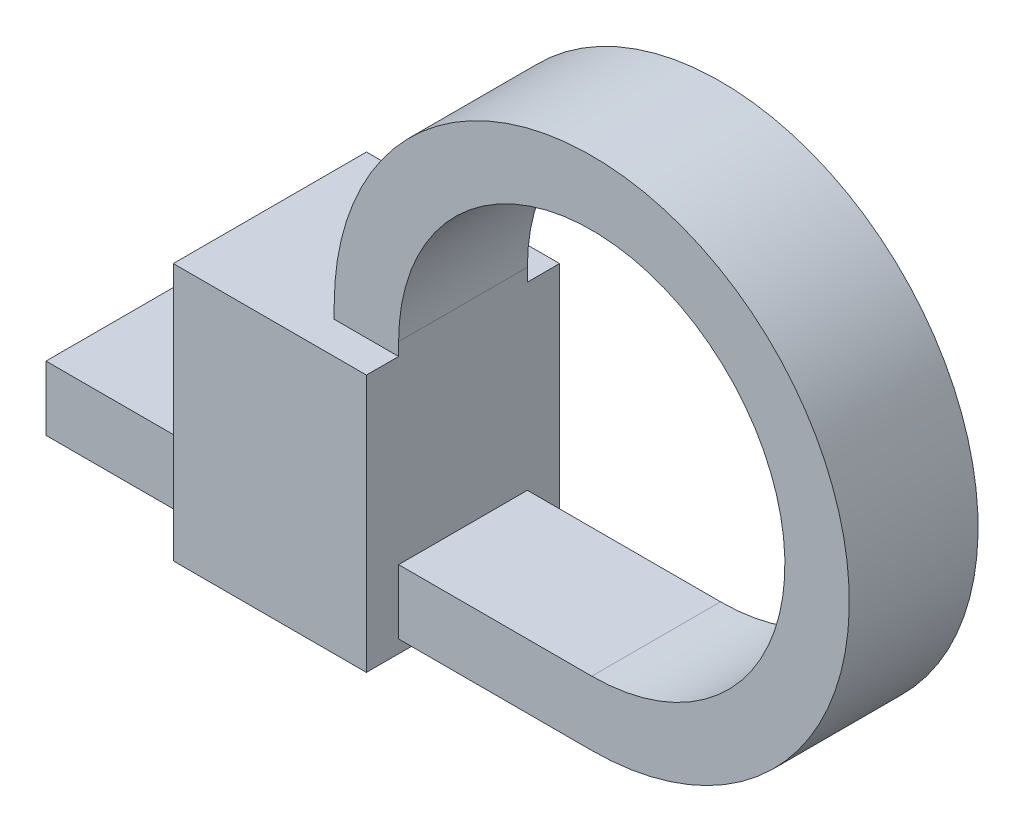
ISO-10303-21;
HEADER;
FILE_DESCRIPTION(('STEP AP214'),'2;1');
FILE_NAME('part.step','',(''),(''),'','','');
FILE_SCHEMA(('AUTOMOTIVE_DESIGN { 1 0 10303 214 1 1 1 1 }'));
ENDSEC;
DATA;
#1=APPLICATION_CONTEXT('core data for automotive mechanical design processes');
#2=APPLICATION_PROTOCOL_DEFINITION('international standard','automotive_design',2000,#1);
#3=PRODUCT_CONTEXT('',#1,'mechanical');
#4=PRODUCT('Part','Part','',(#3));
#5=PRODUCT_RELATED_PRODUCT_CATEGORY('part','',(#4));
#6=PRODUCT_DEFINITION_FORMATION('','',#4);
#7=PRODUCT_DEFINITION_CONTEXT('part definition',#1,'design');
#8=PRODUCT_DEFINITION('design','',#6,#7);
#9=PRODUCT_DEFINITION_SHAPE('','',#8);
#10=(LENGTH_UNIT() NAMED_UNIT(*) SI_UNIT(.MILLI.,.METRE.));
#11=(NAMED_UNIT(*) PLANE_ANGLE_UNIT() SI_UNIT($,.RADIAN.));
#12=(NAMED_UNIT(*) SI_UNIT($,.STERADIAN.) SOLID_ANGLE_UNIT());
#13=UNCERTAINTY_MEASURE_WITH_UNIT(LENGTH_MEASURE(1.E-05),#10,'distance_accuracy_value','');
#14=(GEOMETRIC_REPRESENTATION_CONTEXT(3) GLOBAL_UNCERTAINTY_ASSIGNED_CONTEXT((#13)) GLOBAL_UNIT_ASSIGNED_CONTEXT((#10,
#11,#12)) REPRESENTATION_CONTEXT('',''));
#15=CARTESIAN_POINT('',(0.,0.,0.));
#16=DIRECTION('',(0.,0.,1.));
#17=DIRECTION('',(1.,0.,0.));
#18=AXIS2_PLACEMENT_3D('',#15,#16,#17);
#19=CARTESIAN_POINT('',(-4.40192378864662,2.5,2.));
#20=DIRECTION('',(1.,0.,0.));
#21=DIRECTION('',(0.,1.,0.));
#22=AXIS2_PLACEMENT_3D('',#19,#20,#21);
#23=PLANE('',#22);
#24=DIRECTION('',(0.,0.,-1.));
#25=VECTOR('',#24,1.);
#26=CARTESIAN_POINT('',(-4.40192378864662,3.7,2.));
#27=LINE('',#26,#25);
#28=CARTESIAN_POINT('',(-4.40192378864662,3.7,0.5));
#29=VERTEX_POINT('',#28);
#30=CARTESIAN_POINT('',(-4.40192378864662,3.7,-1.5));
#31=VERTEX_POINT('',#30);
#32=EDGE_CURVE('E54',#29,#31,#27,.T.);
#33=ORIENTED_EDGE('',*,*,#32,.F.);
#34=DIRECTION('',(0.,-1.,0.));
#35=VECTOR('',#34,1.);
#36=CARTESIAN_POINT('',(-4.40192378864662,2.5,0.5));
#37=LINE('',#36,#35);
#38=CARTESIAN_POINT('',(-4.40192378864662,2.7,0.5));
#39=VERTEX_POINT('',#38);
#40=EDGE_CURVE('E208',#29,#39,#37,.T.);
#41=ORIENTED_EDGE('',*,*,#40,.T.);
#42=DIRECTION('',(0.,0.,-1.));
#43=VECTOR('',#42,1.);
#44=CARTESIAN_POINT('',(-4.40192378864662,2.7,2.));
#45=LINE('',#44,#43);
#46=CARTESIAN_POINT('',(-4.40192378864662,2.7,-1.5));
#47=VERTEX_POINT('',#46);
#48=EDGE_CURVE('E210',#39,#47,#45,.T.);
#49=ORIENTED_EDGE('',*,*,#48,.T.);
#50=DIRECTION('',(0.,-1.,0.));
#51=VECTOR('',#50,1.);
#52=CARTESIAN_POINT('',(-4.40192378864662,2.5,-1.5));
#53=LINE('',#52,#51);
#54=EDGE_CURVE('E221',#31,#47,#53,.T.);
#55=ORIENTED_EDGE('',*,*,#54,.F.);
#56=EDGE_LOOP('',(#33,#41,#49,#55));
#57=FACE_BOUND('',#56,.T.);
#58=DIRECTION('',(0.,-1.,0.));
#59=VECTOR('',#58,1.);
#60=CARTESIAN_POINT('',(-4.40192378864662,2.5,-2.));
#61=LINE('',#60,#59);
#62=CARTESIAN_POINT('',(-4.40192378864662,6.5,-2.));
#63=VERTEX_POINT('',#62);
#64=CARTESIAN_POINT('',(-4.40192378864662,2.5,-2.));
#65=VERTEX_POINT('',#64);
#66=EDGE_CURVE('E167',#63,#65,#61,.T.);
#67=ORIENTED_EDGE('',*,*,#66,.T.);
#68=DIRECTION('',(0.,0.,-1.));
#69=VECTOR('',#68,1.);
#70=CARTESIAN_POINT('',(-4.40192378864662,2.5,2.));
#71=LINE('',#70,#69);
#72=CARTESIAN_POINT('',(-4.40192378864662,2.5,1.));
#73=VERTEX_POINT('',#72);
#74=EDGE_CURVE('E161',#73,#65,#71,.T.);
#75=ORIENTED_EDGE('',*,*,#74,.F.);
#76=DIRECTION('',(0.,-1.,0.));
#77=VECTOR('',#76,1.);
#78=CARTESIAN_POINT('',(-4.40192378864662,2.5,1.));
#79=LINE('',#78,#77);
#80=CARTESIAN_POINT('',(-4.40192378864662,6.5,1.));
#81=VERTEX_POINT('',#80);
#82=EDGE_CURVE('E182',#81,#73,#79,.T.);
#83=ORIENTED_EDGE('',*,*,#82,.F.);
#84=DIRECTION('',(0.,0.,-1.));
#85=VECTOR('',#84,1.);
#86=CARTESIAN_POINT('',(-4.40192378864662,6.5,2.));
#87=LINE('',#86,#85);
#88=EDGE_CURVE('E188',#81,#63,#87,.T.);
#89=ORIENTED_EDGE('',*,*,#88,.T.);
#90=EDGE_LOOP('',(#67,#75,#83,#89));
#91=FACE_BOUND('',#90,.T.);
#92=ADVANCED_FACE('F35',(#57,#91),#23,.F.);
#93=CARTESIAN_POINT('',(-1.40192378864662,2.5,2.));
#94=DIRECTION('',(-1.,0.,0.));
#95=DIRECTION('',(0.,0.,1.));
#96=AXIS2_PLACEMENT_3D('',#93,#94,#95);
#97=PLANE('',#96);
#98=DIRECTION('',(0.,0.,1.));
#99=VECTOR('',#98,1.);
#100=CARTESIAN_POINT('',(-1.40192378864662,2.7,2.));
#101=LINE('',#100,#99);
#102=CARTESIAN_POINT('',(-1.40192378864662,2.7,-1.5));
#103=VERTEX_POINT('',#102);
#104=CARTESIAN_POINT('',(-1.40192378864662,2.7,0.5));
#105=VERTEX_POINT('',#104);
#106=EDGE_CURVE('E45',#103,#105,#101,.T.);
#107=ORIENTED_EDGE('',*,*,#106,.T.);
#108=DIRECTION('',(0.,1.,0.));
#109=VECTOR('',#108,1.);
#110=CARTESIAN_POINT('',(-1.40192378864662,2.5,0.5));
#111=LINE('',#110,#109);
#112=CARTESIAN_POINT('',(-1.40192378864662,3.7,0.5));
#113=VERTEX_POINT('',#112);
#114=EDGE_CURVE('E211',#105,#113,#111,.T.);
#115=ORIENTED_EDGE('',*,*,#114,.T.);
#116=DIRECTION('',(0.,0.,1.));
#117=VECTOR('',#116,1.);
#118=CARTESIAN_POINT('',(-1.40192378864662,3.7,2.));
#119=LINE('',#118,#117);
#120=CARTESIAN_POINT('',(-1.40192378864662,3.7,-1.5));
#121=VERTEX_POINT('',#120);
#122=EDGE_CURVE('E12',#121,#113,#119,.T.);
#123=ORIENTED_EDGE('',*,*,#122,.F.);
#124=DIRECTION('',(0.,1.,0.));
#125=VECTOR('',#124,1.);
#126=CARTESIAN_POINT('',(-1.40192378864662,2.5,-1.5));
#127=LINE('',#126,#125);
#128=EDGE_CURVE('E290',#103,#121,#127,.T.);
#129=ORIENTED_EDGE('',*,*,#128,.F.);
#130=EDGE_LOOP('',(#107,#115,#123,#129));
#131=FACE_BOUND('',#130,.T.);
#132=DIRECTION('',(0.,1.,0.));
#133=VECTOR('',#132,1.);
#134=CARTESIAN_POINT('',(-1.40192378864662,2.5,-2.));
#135=LINE('',#134,#133);
#136=CARTESIAN_POINT('',(-1.40192378864662,2.5,-2.));
#137=VERTEX_POINT('',#136);
#138=CARTESIAN_POINT('',(-1.40192378864662,6.5,-2.));
#139=VERTEX_POINT('',#138);
#140=EDGE_CURVE('E166',#137,#139,#135,.T.);
#141=ORIENTED_EDGE('',*,*,#140,.T.);
#142=DIRECTION('',(0.,0.,-1.));
#143=VECTOR('',#142,1.);
#144=CARTESIAN_POINT('',(-1.40192378864662,6.5,2.));
#145=LINE('',#144,#143);
#146=CARTESIAN_POINT('',(-1.40192378864662,6.5,-1.5));
#147=VERTEX_POINT('',#146);
#148=EDGE_CURVE('E191',#147,#139,#145,.T.);
#149=ORIENTED_EDGE('',*,*,#148,.F.);
#150=DIRECTION('',(0.,1.,0.));
#151=VECTOR('',#150,1.);
#152=CARTESIAN_POINT('',(-1.40192378864662,6.5,-1.5));
#153=LINE('',#152,#151);
#154=CARTESIAN_POINT('',(-1.40192378864662,6.7,-1.5));
#155=VERTEX_POINT('',#154);
#156=EDGE_CURVE('E273',#147,#155,#153,.T.);
#157=ORIENTED_EDGE('',*,*,#156,.T.);
#158=DIRECTION('',(0.,0.,-1.));
#159=VECTOR('',#158,1.);
#160=CARTESIAN_POINT('',(-1.40192378864662,6.7,1.5));
#161=LINE('',#160,#159);
#162=CARTESIAN_POINT('',(-1.40192378864662,6.7,0.5));
#163=VERTEX_POINT('',#162);
#164=EDGE_CURVE('E277',#163,#155,#161,.T.);
#165=ORIENTED_EDGE('',*,*,#164,.F.);
#166=DIRECTION('',(0.,1.,0.));
#167=VECTOR('',#166,1.);
#168=CARTESIAN_POINT('',(-1.40192378864662,2.5,0.5));
#169=LINE('',#168,#167);
#170=CARTESIAN_POINT('',(-1.40192378864662,6.5,0.5));
#171=VERTEX_POINT('',#170);
#172=EDGE_CURVE('E227',#171,#163,#169,.T.);
#173=ORIENTED_EDGE('',*,*,#172,.F.);
#174=CARTESIAN_POINT('',(-1.40192378864662,6.5,1.));
#175=VERTEX_POINT('',#174);
#176=EDGE_CURVE('E177',#175,#171,#145,.T.);
#177=ORIENTED_EDGE('',*,*,#176,.F.);
#178=DIRECTION('',(0.,1.,0.));
#179=VECTOR('',#178,1.);
#180=CARTESIAN_POINT('',(-1.40192378864662,2.5,1.));
#181=LINE('',#180,#179);
#182=CARTESIAN_POINT('',(-1.40192378864662,2.5,1.));
#183=VERTEX_POINT('',#182);
#184=EDGE_CURVE('E176',#183,#175,#181,.T.);
#185=ORIENTED_EDGE('',*,*,#184,.F.);
#186=DIRECTION('',(0.,0.,-1.));
#187=VECTOR('',#186,1.);
#188=CARTESIAN_POINT('',(-1.40192378864662,2.5,2.));
#189=LINE('',#188,#187);
#190=EDGE_CURVE('E158',#183,#137,#189,.T.);
#191=ORIENTED_EDGE('',*,*,#190,.T.);
#192=EDGE_LOOP('',(#141,#149,#157,#165,#173,#177,#185,#191));
#193=FACE_BOUND('',#192,.T.);
#194=ADVANCED_FACE('F172',(#131,#193),#97,.F.);
#195=CARTESIAN_POINT('',(-4.40192378864662,6.5,2.));
#196=DIRECTION('',(0.,-1.,0.));
#197=DIRECTION('',(1.,0.,0.));
#198=AXIS2_PLACEMENT_3D('',#195,#196,#197);
#199=PLANE('',#198);
#200=ORIENTED_EDGE('',*,*,#176,.T.);
#201=DIRECTION('',(-1.,0.,0.));
#202=VECTOR('',#201,1.);
#203=CARTESIAN_POINT('',(-4.40192378864662,6.5,0.5));
#204=LINE('',#203,#202);
#205=CARTESIAN_POINT('',(-2.40192378864662,6.5,0.5));
#206=VERTEX_POINT('',#205);
#207=EDGE_CURVE('E229',#171,#206,#204,.T.);
#208=ORIENTED_EDGE('',*,*,#207,.T.);
#209=DIRECTION('',(0.,0.,-1.));
#210=VECTOR('',#209,1.);
#211=CARTESIAN_POINT('',(-2.40192378864662,6.5,1.5));
#212=LINE('',#211,#210);
#213=CARTESIAN_POINT('',(-2.40192378864662,6.5,-1.5));
#214=VERTEX_POINT('',#213);
#215=EDGE_CURVE('E280',#206,#214,#212,.T.);
#216=ORIENTED_EDGE('',*,*,#215,.T.);
#217=DIRECTION('',(-1.,0.,0.));
#218=VECTOR('',#217,1.);
#219=CARTESIAN_POINT('',(-1.40192378864662,6.5,-1.5));
#220=LINE('',#219,#218);
#221=EDGE_CURVE('E270',#147,#214,#220,.T.);
#222=ORIENTED_EDGE('',*,*,#221,.F.);
#223=ORIENTED_EDGE('',*,*,#148,.T.);
#224=DIRECTION('',(-1.,0.,0.));
#225=VECTOR('',#224,1.);
#226=CARTESIAN_POINT('',(-4.40192378864662,6.5,-2.));
#227=LINE('',#226,#225);
#228=EDGE_CURVE('E180',#139,#63,#227,.T.);
#229=ORIENTED_EDGE('',*,*,#228,.T.);
#230=ORIENTED_EDGE('',*,*,#88,.F.);
#231=DIRECTION('',(-1.,0.,0.));
#232=VECTOR('',#231,1.);
#233=CARTESIAN_POINT('',(-4.40192378864661,6.5,1.));
#234=LINE('',#233,#232);
#235=EDGE_CURVE('E192',#175,#81,#234,.T.);
#236=ORIENTED_EDGE('',*,*,#235,.F.);
#237=EDGE_LOOP('',(#200,#208,#216,#222,#223,#229,#230,#236));
#238=FACE_BOUND('',#237,.T.);
#239=ADVANCED_FACE('F326',(#238),#199,.F.);
#240=CARTESIAN_POINT('',(-4.40192378864662,2.5,1.));
#241=DIRECTION('',(0.,0.,-1.));
#242=DIRECTION('',(-1.,0.,0.));
#243=AXIS2_PLACEMENT_3D('',#240,#241,#242);
#244=PLANE('',#243);
#245=ORIENTED_EDGE('',*,*,#82,.T.);
#246=DIRECTION('',(1.,0.,0.));
#247=VECTOR('',#246,1.);
#248=CARTESIAN_POINT('',(-4.40192378864662,2.5,1.));
#249=LINE('',#248,#247);
#250=EDGE_CURVE('E204',#73,#183,#249,.T.);
#251=ORIENTED_EDGE('',*,*,#250,.T.);
#252=ORIENTED_EDGE('',*,*,#184,.T.);
#253=ORIENTED_EDGE('',*,*,#235,.T.);
#254=EDGE_LOOP('',(#245,#251,#252,#253));
#255=FACE_BOUND('',#254,.T.);
#256=ADVANCED_FACE('F329',(#255),#244,.F.);
#257=CARTESIAN_POINT('',(-4.40192378864662,2.5,-2.));
#258=DIRECTION('',(0.,0.,-1.));
#259=DIRECTION('',(-1.,0.,0.));
#260=AXIS2_PLACEMENT_3D('',#257,#258,#259);
#261=PLANE('',#260);
#262=ORIENTED_EDGE('',*,*,#66,.F.);
#263=ORIENTED_EDGE('',*,*,#228,.F.);
#264=ORIENTED_EDGE('',*,*,#140,.F.);
#265=DIRECTION('',(1.,0.,0.));
#266=VECTOR('',#265,1.);
#267=CARTESIAN_POINT('',(-4.40192378864662,2.5,-2.));
#268=LINE('',#267,#266);
#269=EDGE_CURVE('E155',#65,#137,#268,.T.);
#270=ORIENTED_EDGE('',*,*,#269,.F.);
#271=EDGE_LOOP('',(#262,#263,#264,#270));
#272=FACE_BOUND('',#271,.T.);
#273=ADVANCED_FACE('F179',(#272),#261,.T.);
#274=CARTESIAN_POINT('',(1.59807621135338,6.7,1.5));
#275=DIRECTION('',(0.,0.,-1.));
#276=DIRECTION('',(-1.,0.,0.));
#277=AXIS2_PLACEMENT_3D('',#274,#275,#276);
#278=CYLINDRICAL_SURFACE('',#277,4.);
#279=CARTESIAN_POINT('',(1.59807621135338,6.7,-1.5));
#280=DIRECTION('',(0.,0.,1.));
#281=DIRECTION('',(1.,0.,0.));
#282=AXIS2_PLACEMENT_3D('',#279,#280,#281);
#283=CIRCLE('',#282,4.);
#284=CARTESIAN_POINT('',(-2.40192378864662,6.7,-1.5));
#285=VERTEX_POINT('',#284);
#286=CARTESIAN_POINT('',(1.59807621135338,2.7,-1.5));
#287=VERTEX_POINT('',#286);
#288=EDGE_CURVE('E264',#285,#287,#283,.F.);
#289=ORIENTED_EDGE('',*,*,#288,.F.);
#290=DIRECTION('',(0.,0.,-1.));
#291=VECTOR('',#290,1.);
#292=CARTESIAN_POINT('',(-2.40192378864662,6.7,1.5));
#293=LINE('',#292,#291);
#294=CARTESIAN_POINT('',(-2.40192378864662,6.7,0.5));
#295=VERTEX_POINT('',#294);
#296=EDGE_CURVE('E282',#295,#285,#293,.T.);
#297=ORIENTED_EDGE('',*,*,#296,.F.);
#298=CARTESIAN_POINT('',(1.59807621135338,6.7,0.5));
#299=DIRECTION('',(0.,0.,1.));
#300=DIRECTION('',(1.,0.,0.));
#301=AXIS2_PLACEMENT_3D('',#298,#299,#300);
#302=CIRCLE('',#301,4.);
#303=CARTESIAN_POINT('',(1.59807621135338,2.7,0.5));
#304=VERTEX_POINT('',#303);
#305=EDGE_CURVE('E233',#295,#304,#302,.F.);
#306=ORIENTED_EDGE('',*,*,#305,.T.);
#307=DIRECTION('',(0.,0.,-1.));
#308=VECTOR('',#307,1.);
#309=CARTESIAN_POINT('',(1.59807621135338,2.7,1.5));
#310=LINE('',#309,#308);
#311=EDGE_CURVE('E90',#304,#287,#310,.T.);
#312=ORIENTED_EDGE('',*,*,#311,.T.);
#313=EDGE_LOOP('',(#289,#297,#306,#312));
#314=FACE_BOUND('',#313,.T.);
#315=ADVANCED_FACE('F336',(#314),#278,.T.);
#316=CARTESIAN_POINT('',(1.59807621135338,6.7,1.5));
#317=DIRECTION('',(0.,0.,-1.));
#318=DIRECTION('',(-1.,0.,0.));
#319=AXIS2_PLACEMENT_3D('',#316,#317,#318);
#320=CYLINDRICAL_SURFACE('',#319,3.);
#321=CARTESIAN_POINT('',(1.59807621135338,6.7,-1.5));
#322=DIRECTION('',(0.,0.,-1.));
#323=DIRECTION('',(-1.,0.,0.));
#324=AXIS2_PLACEMENT_3D('',#321,#322,#323);
#325=CIRCLE('',#324,3.);
#326=CARTESIAN_POINT('',(1.59807621135338,3.7,-1.5));
#327=VERTEX_POINT('',#326);
#328=EDGE_CURVE('E219',#155,#327,#325,.T.);
#329=ORIENTED_EDGE('',*,*,#328,.T.);
#330=DIRECTION('',(0.,0.,-1.));
#331=VECTOR('',#330,1.);
#332=CARTESIAN_POINT('',(1.59807621135338,3.7,1.5));
#333=LINE('',#332,#331);
#334=CARTESIAN_POINT('',(1.59807621135338,3.7,0.5));
#335=VERTEX_POINT('',#334);
#336=EDGE_CURVE('E226',#335,#327,#333,.T.);
#337=ORIENTED_EDGE('',*,*,#336,.F.);
#338=CARTESIAN_POINT('',(1.59807621135338,6.7,0.5));
#339=DIRECTION('',(0.,0.,1.));
#340=DIRECTION('',(1.,0.,0.));
#341=AXIS2_PLACEMENT_3D('',#338,#339,#340);
#342=CIRCLE('',#341,3.);
#343=EDGE_CURVE('E224',#163,#335,#342,.F.);
#344=ORIENTED_EDGE('',*,*,#343,.F.);
#345=ORIENTED_EDGE('',*,*,#164,.T.);
#346=EDGE_LOOP('',(#329,#337,#344,#345));
#347=FACE_BOUND('',#346,.T.);
#348=ADVANCED_FACE('F346',(#347),#320,.F.);
#349=CARTESIAN_POINT('',(1.59807621135338,6.7,0.5));
#350=DIRECTION('',(0.,0.,1.));
#351=DIRECTION('',(1.,0.,0.));
#352=AXIS2_PLACEMENT_3D('',#349,#350,#351);
#353=PLANE('',#352);
#354=ORIENTED_EDGE('',*,*,#114,.F.);
#355=DIRECTION('',(-1.,0.,0.));
#356=VECTOR('',#355,1.);
#357=CARTESIAN_POINT('',(1.59807621135338,2.7,0.5));
#358=LINE('',#357,#356);
#359=EDGE_CURVE('E39',#304,#105,#358,.T.);
#360=ORIENTED_EDGE('',*,*,#359,.F.);
#361=ORIENTED_EDGE('',*,*,#305,.F.);
#362=DIRECTION('',(0.,1.,0.));
#363=VECTOR('',#362,1.);
#364=CARTESIAN_POINT('',(-2.40192378864662,6.5,0.5));
#365=LINE('',#364,#363);
#366=EDGE_CURVE('E231',#206,#295,#365,.T.);
#367=ORIENTED_EDGE('',*,*,#366,.F.);
#368=ORIENTED_EDGE('',*,*,#207,.F.);
#369=ORIENTED_EDGE('',*,*,#172,.T.);
#370=ORIENTED_EDGE('',*,*,#343,.T.);
#371=DIRECTION('',(-1.,0.,0.));
#372=VECTOR('',#371,1.);
#373=CARTESIAN_POINT('',(1.59807621135338,3.7,0.5));
#374=LINE('',#373,#372);
#375=EDGE_CURVE('E216',#335,#113,#374,.T.);
#376=ORIENTED_EDGE('',*,*,#375,.T.);
#377=EDGE_LOOP('',(#354,#360,#361,#367,#368,#369,#370,#376));
#378=FACE_BOUND('',#377,.T.);
#379=ADVANCED_FACE('F37',(#378),#353,.T.);
#380=CARTESIAN_POINT('',(1.59807621135338,6.7,-1.5));
#381=DIRECTION('',(0.,0.,1.));
#382=DIRECTION('',(1.,0.,0.));
#383=AXIS2_PLACEMENT_3D('',#380,#381,#382);
#384=PLANE('',#383);
#385=DIRECTION('',(-1.,0.,0.));
#386=VECTOR('',#385,1.);
#387=CARTESIAN_POINT('',(1.59807621135338,2.7,-1.5));
#388=LINE('',#387,#386);
#389=EDGE_CURVE('E262',#287,#103,#388,.T.);
#390=ORIENTED_EDGE('',*,*,#389,.T.);
#391=ORIENTED_EDGE('',*,*,#128,.T.);
#392=DIRECTION('',(-1.,0.,0.));
#393=VECTOR('',#392,1.);
#394=CARTESIAN_POINT('',(1.59807621135338,3.7,-1.5));
#395=LINE('',#394,#393);
#396=EDGE_CURVE('E251',#327,#121,#395,.T.);
#397=ORIENTED_EDGE('',*,*,#396,.F.);
#398=ORIENTED_EDGE('',*,*,#328,.F.);
#399=ORIENTED_EDGE('',*,*,#156,.F.);
#400=ORIENTED_EDGE('',*,*,#221,.T.);
#401=DIRECTION('',(0.,1.,0.));
#402=VECTOR('',#401,1.);
#403=CARTESIAN_POINT('',(-2.40192378864662,6.5,-1.5));
#404=LINE('',#403,#402);
#405=EDGE_CURVE('E267',#214,#285,#404,.T.);
#406=ORIENTED_EDGE('',*,*,#405,.T.);
#407=ORIENTED_EDGE('',*,*,#288,.T.);
#408=EDGE_LOOP('',(#390,#391,#397,#398,#399,#400,#406,#407));
#409=FACE_BOUND('',#408,.T.);
#410=ADVANCED_FACE('F344',(#409),#384,.F.);
#411=CARTESIAN_POINT('',(-2.40192378864662,6.5,1.5));
#412=DIRECTION('',(-1.,0.,0.));
#413=DIRECTION('',(0.,0.,1.));
#414=AXIS2_PLACEMENT_3D('',#411,#412,#413);
#415=PLANE('',#414);
#416=ORIENTED_EDGE('',*,*,#405,.F.);
#417=ORIENTED_EDGE('',*,*,#215,.F.);
#418=ORIENTED_EDGE('',*,*,#366,.T.);
#419=ORIENTED_EDGE('',*,*,#296,.T.);
#420=EDGE_LOOP('',(#416,#417,#418,#419));
#421=FACE_BOUND('',#420,.T.);
#422=ADVANCED_FACE('F320',(#421),#415,.T.);
#423=CARTESIAN_POINT('',(1.59807621135338,2.7,1.5));
#424=DIRECTION('',(0.,-1.,0.));
#425=DIRECTION('',(1.,0.,0.));
#426=AXIS2_PLACEMENT_3D('',#423,#424,#425);
#427=PLANE('',#426);
#428=ORIENTED_EDGE('',*,*,#106,.F.);
#429=ORIENTED_EDGE('',*,*,#389,.F.);
#430=ORIENTED_EDGE('',*,*,#311,.F.);
#431=ORIENTED_EDGE('',*,*,#359,.T.);
#432=EDGE_LOOP('',(#428,#429,#430,#431));
#433=FACE_BOUND('',#432,.T.);
#434=ADVANCED_FACE('F238',(#433),#427,.T.);
#435=CARTESIAN_POINT('',(1.59807621135338,3.7,1.5));
#436=DIRECTION('',(0.,-1.,0.));
#437=DIRECTION('',(1.,0.,0.));
#438=AXIS2_PLACEMENT_3D('',#435,#436,#437);
#439=PLANE('',#438);
#440=ORIENTED_EDGE('',*,*,#396,.T.);
#441=ORIENTED_EDGE('',*,*,#122,.T.);
#442=ORIENTED_EDGE('',*,*,#375,.F.);
#443=ORIENTED_EDGE('',*,*,#336,.T.);
#444=EDGE_LOOP('',(#440,#441,#442,#443));
#445=FACE_BOUND('',#444,.T.);
#446=ADVANCED_FACE('F248',(#445),#439,.F.);
#447=DIRECTION('',(-1.,0.,0.));
#448=VECTOR('',#447,1.);
#449=CARTESIAN_POINT('',(1.59807621135338,3.7,0.5));
#450=LINE('',#449,#448);
#451=CARTESIAN_POINT('',(-6.87859684007711,3.7,0.5));
#452=VERTEX_POINT('',#451);
#453=EDGE_CURVE('E217',#29,#452,#450,.T.);
#454=ORIENTED_EDGE('',*,*,#453,.F.);
#455=ORIENTED_EDGE('',*,*,#32,.T.);
#456=CARTESIAN_POINT('',(-6.87859684007711,3.7,-1.5));
#457=VERTEX_POINT('',#456);
#458=EDGE_CURVE('E256',#31,#457,#395,.T.);
#459=ORIENTED_EDGE('',*,*,#458,.T.);
#460=DIRECTION('',(0.,0.,-1.));
#461=VECTOR('',#460,1.);
#462=CARTESIAN_POINT('',(-6.87859684007711,3.7,1.5));
#463=LINE('',#462,#461);
#464=EDGE_CURVE('E287',#452,#457,#463,.T.);
#465=ORIENTED_EDGE('',*,*,#464,.F.);
#466=EDGE_LOOP('',(#454,#455,#459,#465));
#467=FACE_BOUND('',#466,.T.);
#468=ADVANCED_FACE('F297',(#467),#439,.F.);
#469=ORIENTED_EDGE('',*,*,#48,.F.);
#470=DIRECTION('',(-1.,0.,0.));
#471=VECTOR('',#470,1.);
#472=CARTESIAN_POINT('',(1.59807621135338,2.7,0.5));
#473=LINE('',#472,#471);
#474=CARTESIAN_POINT('',(-6.87859684007711,2.7,0.5));
#475=VERTEX_POINT('',#474);
#476=EDGE_CURVE('E97',#39,#475,#473,.T.);
#477=ORIENTED_EDGE('',*,*,#476,.T.);
#478=DIRECTION('',(0.,0.,-1.));
#479=VECTOR('',#478,1.);
#480=CARTESIAN_POINT('',(-6.87859684007711,2.7,1.5));
#481=LINE('',#480,#479);
#482=CARTESIAN_POINT('',(-6.87859684007711,2.7,-1.5));
#483=VERTEX_POINT('',#482);
#484=EDGE_CURVE('E285',#475,#483,#481,.T.);
#485=ORIENTED_EDGE('',*,*,#484,.T.);
#486=EDGE_CURVE('E259',#47,#483,#388,.T.);
#487=ORIENTED_EDGE('',*,*,#486,.F.);
#488=EDGE_LOOP('',(#469,#477,#485,#487));
#489=FACE_BOUND('',#488,.T.);
#490=ADVANCED_FACE('F309',(#489),#427,.T.);
#491=ORIENTED_EDGE('',*,*,#40,.F.);
#492=ORIENTED_EDGE('',*,*,#453,.T.);
#493=DIRECTION('',(0.,1.,0.));
#494=VECTOR('',#493,1.);
#495=CARTESIAN_POINT('',(-6.87859684007711,2.7,0.5));
#496=LINE('',#495,#494);
#497=EDGE_CURVE('E213',#475,#452,#496,.T.);
#498=ORIENTED_EDGE('',*,*,#497,.F.);
#499=ORIENTED_EDGE('',*,*,#476,.F.);
#500=EDGE_LOOP('',(#491,#492,#498,#499));
#501=FACE_BOUND('',#500,.T.);
#502=ADVANCED_FACE('F307',(#501),#353,.T.);
#503=ORIENTED_EDGE('',*,*,#458,.F.);
#504=ORIENTED_EDGE('',*,*,#54,.T.);
#505=ORIENTED_EDGE('',*,*,#486,.T.);
#506=DIRECTION('',(0.,1.,0.));
#507=VECTOR('',#506,1.);
#508=CARTESIAN_POINT('',(-6.87859684007711,2.7,-1.5));
#509=LINE('',#508,#507);
#510=EDGE_CURVE('E255',#483,#457,#509,.T.);
#511=ORIENTED_EDGE('',*,*,#510,.T.);
#512=EDGE_LOOP('',(#503,#504,#505,#511));
#513=FACE_BOUND('',#512,.T.);
#514=ADVANCED_FACE('F300',(#513),#384,.F.);
#515=CARTESIAN_POINT('',(-6.87859684007711,2.7,1.5));
#516=DIRECTION('',(-1.,0.,0.));
#517=DIRECTION('',(0.,0.,1.));
#518=AXIS2_PLACEMENT_3D('',#515,#516,#517);
#519=PLANE('',#518);
#520=ORIENTED_EDGE('',*,*,#510,.F.);
#521=ORIENTED_EDGE('',*,*,#484,.F.);
#522=ORIENTED_EDGE('',*,*,#497,.T.);
#523=ORIENTED_EDGE('',*,*,#464,.T.);
#524=EDGE_LOOP('',(#520,#521,#522,#523));
#525=FACE_BOUND('',#524,.T.);
#526=ADVANCED_FACE('F304',(#525),#519,.T.);
#527=CARTESIAN_POINT('',(0.,2.5,0.));
#528=DIRECTION('',(0.,-1.,0.));
#529=DIRECTION('',(0.,0.,-1.));
#530=AXIS2_PLACEMENT_3D('',#527,#528,#529);
#531=PLANE('',#530);
#532=ORIENTED_EDGE('',*,*,#250,.F.);
#533=ORIENTED_EDGE('',*,*,#74,.T.);
#534=ORIENTED_EDGE('',*,*,#269,.T.);
#535=ORIENTED_EDGE('',*,*,#190,.F.);
#536=EDGE_LOOP('',(#532,#533,#534,#535));
#537=FACE_BOUND('',#536,.T.);
#538=ADVANCED_FACE('F157',(#537),#531,.T.);
#539=CLOSED_SHELL('',(#92,#194,#239,#256,#273,#315,#348,#379,#410,#422,#434,#446,#468,#490,#502,
#514,#526,#538));
#540=MANIFOLD_SOLID_BREP('B2',#539);
#541=ADVANCED_BREP_SHAPE_REPRESENTATION('',(#18,#540),#14);
#542=SHAPE_DEFINITION_REPRESENTATION(#9,#541);
ENDSEC;
END-ISO-10303-21;
